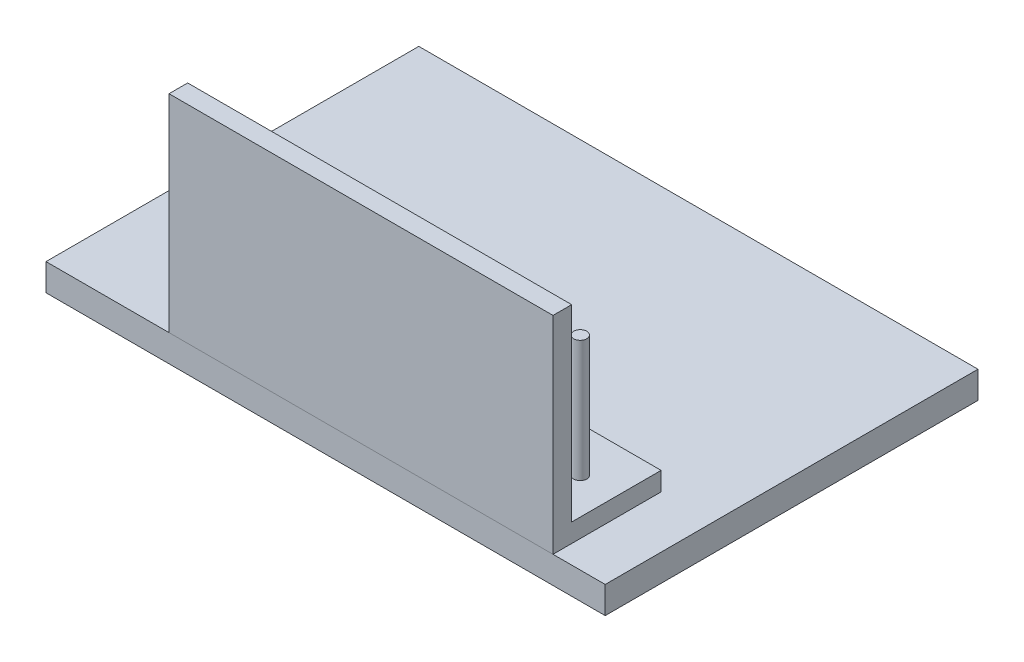
ISO-10303-21;
HEADER;
FILE_DESCRIPTION(('STEP AP214'),'2;1');
FILE_NAME('part.step','',(''),(''),'','','');
FILE_SCHEMA(('AUTOMOTIVE_DESIGN { 1 0 10303 214 1 1 1 1 }'));
ENDSEC;
DATA;
#1=APPLICATION_CONTEXT('core data for automotive mechanical design processes');
#2=APPLICATION_PROTOCOL_DEFINITION('international standard','automotive_design',2000,#1);
#3=PRODUCT_CONTEXT('',#1,'mechanical');
#4=PRODUCT('Part','Part','',(#3));
#5=PRODUCT_RELATED_PRODUCT_CATEGORY('part','',(#4));
#6=PRODUCT_DEFINITION_FORMATION('','',#4);
#7=PRODUCT_DEFINITION_CONTEXT('part definition',#1,'design');
#8=PRODUCT_DEFINITION('design','',#6,#7);
#9=PRODUCT_DEFINITION_SHAPE('','',#8);
#10=(LENGTH_UNIT() NAMED_UNIT(*) SI_UNIT(.MILLI.,.METRE.));
#11=(NAMED_UNIT(*) PLANE_ANGLE_UNIT() SI_UNIT($,.RADIAN.));
#12=(NAMED_UNIT(*) SI_UNIT($,.STERADIAN.) SOLID_ANGLE_UNIT());
#13=UNCERTAINTY_MEASURE_WITH_UNIT(LENGTH_MEASURE(1.E-05),#10,'distance_accuracy_value','');
#14=(GEOMETRIC_REPRESENTATION_CONTEXT(3) GLOBAL_UNCERTAINTY_ASSIGNED_CONTEXT((#13)) GLOBAL_UNIT_ASSIGNED_CONTEXT((#10,
#11,#12)) REPRESENTATION_CONTEXT('',''));
#15=CARTESIAN_POINT('',(0.,0.,0.));
#16=DIRECTION('',(0.,0.,1.));
#17=DIRECTION('',(1.,0.,0.));
#18=AXIS2_PLACEMENT_3D('',#15,#16,#17);
#19=CARTESIAN_POINT('',(22.8718219077427,8.97,16.6));
#20=DIRECTION('',(0.,-1.,0.));
#21=DIRECTION('',(0.,0.,1.));
#22=AXIS2_PLACEMENT_3D('',#19,#20,#21);
#23=CYLINDRICAL_SURFACE('',#22,0.350000000000001);
#24=CARTESIAN_POINT('',(22.8718219077427,8.97,16.6));
#25=DIRECTION('',(0.,-1.,0.));
#26=DIRECTION('',(0.,0.,-1.));
#27=AXIS2_PLACEMENT_3D('',#24,#25,#26);
#28=CIRCLE('',#27,0.350000000000001);
#29=CARTESIAN_POINT('',(22.8718219077427,8.97,16.25));
#30=VERTEX_POINT('',#29);
#31=EDGE_CURVE('E11',#30,#30,#28,.T.);
#32=ORIENTED_EDGE('',*,*,#31,.T.);
#33=EDGE_LOOP('',(#32));
#34=FACE_BOUND('',#33,.T.);
#35=CARTESIAN_POINT('',(22.8718219077427,2.45,16.6));
#36=DIRECTION('',(0.,-1.,0.));
#37=DIRECTION('',(0.,0.,-1.));
#38=AXIS2_PLACEMENT_3D('',#35,#36,#37);
#39=CIRCLE('',#38,0.350000000000001);
#40=CARTESIAN_POINT('',(22.8718219077427,2.45,16.25));
#41=VERTEX_POINT('',#40);
#42=EDGE_CURVE('E49',#41,#41,#39,.T.);
#43=ORIENTED_EDGE('',*,*,#42,.F.);
#44=EDGE_LOOP('',(#43));
#45=FACE_BOUND('',#44,.T.);
#46=ADVANCED_FACE('F46',(#34,#45),#23,.T.);
#47=CARTESIAN_POINT('',(22.8718219077427,8.97,16.6));
#48=DIRECTION('',(0.,1.,0.));
#49=DIRECTION('',(0.,0.,-1.));
#50=AXIS2_PLACEMENT_3D('',#47,#48,#49);
#51=PLANE('',#50);
#52=ORIENTED_EDGE('',*,*,#31,.F.);
#53=EDGE_LOOP('',(#52));
#54=FACE_BOUND('',#53,.T.);
#55=ADVANCED_FACE('F61',(#54),#51,.T.);
#56=CARTESIAN_POINT('',(22.8718219077427,2.45,16.6));
#57=DIRECTION('',(0.,1.,0.));
#58=DIRECTION('',(0.,0.,-1.));
#59=AXIS2_PLACEMENT_3D('',#56,#57,#58);
#60=PLANE('',#59);
#61=ORIENTED_EDGE('',*,*,#42,.T.);
#62=EDGE_LOOP('',(#61));
#63=FACE_BOUND('',#62,.T.);
#64=ADVANCED_FACE('F58',(#63),#60,.F.);
#65=CLOSED_SHELL('',(#46,#55,#64));
#66=MANIFOLD_SOLID_BREP('B2',#65);
#67=CARTESIAN_POINT('',(20.4830931446457,8.97,16.6));
#68=DIRECTION('',(0.,-1.,0.));
#69=DIRECTION('',(0.,0.,1.));
#70=AXIS2_PLACEMENT_3D('',#67,#68,#69);
#71=CYLINDRICAL_SURFACE('',#70,0.350000000000001);
#72=CARTESIAN_POINT('',(20.4830931446457,8.97,16.6));
#73=DIRECTION('',(0.,-1.,0.));
#74=DIRECTION('',(0.,0.,-1.));
#75=AXIS2_PLACEMENT_3D('',#72,#73,#74);
#76=CIRCLE('',#75,0.350000000000001);
#77=CARTESIAN_POINT('',(20.4830931446457,8.97,16.25));
#78=VERTEX_POINT('',#77);
#79=EDGE_CURVE('E45',#78,#78,#76,.T.);
#80=ORIENTED_EDGE('',*,*,#79,.T.);
#81=EDGE_LOOP('',(#80));
#82=FACE_BOUND('',#81,.T.);
#83=CARTESIAN_POINT('',(20.4830931446457,2.45,16.6));
#84=DIRECTION('',(0.,-1.,0.));
#85=DIRECTION('',(0.,0.,-1.));
#86=AXIS2_PLACEMENT_3D('',#83,#84,#85);
#87=CIRCLE('',#86,0.350000000000001);
#88=CARTESIAN_POINT('',(20.4830931446457,2.45,16.25));
#89=VERTEX_POINT('',#88);
#90=EDGE_CURVE('E98',#89,#89,#87,.T.);
#91=ORIENTED_EDGE('',*,*,#90,.F.);
#92=EDGE_LOOP('',(#91));
#93=FACE_BOUND('',#92,.T.);
#94=ADVANCED_FACE('F95',(#82,#93),#71,.T.);
#95=CARTESIAN_POINT('',(20.4830931446457,8.97,16.6));
#96=DIRECTION('',(0.,1.,0.));
#97=DIRECTION('',(0.,0.,-1.));
#98=AXIS2_PLACEMENT_3D('',#95,#96,#97);
#99=PLANE('',#98);
#100=ORIENTED_EDGE('',*,*,#79,.F.);
#101=EDGE_LOOP('',(#100));
#102=FACE_BOUND('',#101,.T.);
#103=ADVANCED_FACE('F110',(#102),#99,.T.);
#104=CARTESIAN_POINT('',(20.4830931446457,2.45,16.6));
#105=DIRECTION('',(0.,1.,0.));
#106=DIRECTION('',(0.,0.,-1.));
#107=AXIS2_PLACEMENT_3D('',#104,#105,#106);
#108=PLANE('',#107);
#109=ORIENTED_EDGE('',*,*,#90,.T.);
#110=EDGE_LOOP('',(#109));
#111=FACE_BOUND('',#110,.T.);
#112=ADVANCED_FACE('F107',(#111),#108,.F.);
#113=CLOSED_SHELL('',(#94,#103,#112));
#114=MANIFOLD_SOLID_BREP('B6',#113);
#115=CARTESIAN_POINT('',(18.0943643815486,8.97,16.6));
#116=DIRECTION('',(0.,-1.,0.));
#117=DIRECTION('',(0.,0.,1.));
#118=AXIS2_PLACEMENT_3D('',#115,#116,#117);
#119=CYLINDRICAL_SURFACE('',#118,0.350000000000001);
#120=CARTESIAN_POINT('',(18.0943643815486,8.97,16.6));
#121=DIRECTION('',(0.,-1.,0.));
#122=DIRECTION('',(0.,0.,-1.));
#123=AXIS2_PLACEMENT_3D('',#120,#121,#122);
#124=CIRCLE('',#123,0.350000000000001);
#125=CARTESIAN_POINT('',(18.0943643815486,8.97,16.25));
#126=VERTEX_POINT('',#125);
#127=EDGE_CURVE('E94',#126,#126,#124,.T.);
#128=ORIENTED_EDGE('',*,*,#127,.T.);
#129=EDGE_LOOP('',(#128));
#130=FACE_BOUND('',#129,.T.);
#131=CARTESIAN_POINT('',(18.0943643815486,2.45,16.6));
#132=DIRECTION('',(0.,-1.,0.));
#133=DIRECTION('',(0.,0.,-1.));
#134=AXIS2_PLACEMENT_3D('',#131,#132,#133);
#135=CIRCLE('',#134,0.350000000000001);
#136=CARTESIAN_POINT('',(18.0943643815486,2.45,16.25));
#137=VERTEX_POINT('',#136);
#138=EDGE_CURVE('E147',#137,#137,#135,.T.);
#139=ORIENTED_EDGE('',*,*,#138,.F.);
#140=EDGE_LOOP('',(#139));
#141=FACE_BOUND('',#140,.T.);
#142=ADVANCED_FACE('F144',(#130,#141),#119,.T.);
#143=CARTESIAN_POINT('',(18.0943643815486,8.97,16.6));
#144=DIRECTION('',(0.,1.,0.));
#145=DIRECTION('',(0.,0.,-1.));
#146=AXIS2_PLACEMENT_3D('',#143,#144,#145);
#147=PLANE('',#146);
#148=ORIENTED_EDGE('',*,*,#127,.F.);
#149=EDGE_LOOP('',(#148));
#150=FACE_BOUND('',#149,.T.);
#151=ADVANCED_FACE('F159',(#150),#147,.T.);
#152=CARTESIAN_POINT('',(18.0943643815486,2.45,16.6));
#153=DIRECTION('',(0.,1.,0.));
#154=DIRECTION('',(0.,0.,-1.));
#155=AXIS2_PLACEMENT_3D('',#152,#153,#154);
#156=PLANE('',#155);
#157=ORIENTED_EDGE('',*,*,#138,.T.);
#158=EDGE_LOOP('',(#157));
#159=FACE_BOUND('',#158,.T.);
#160=ADVANCED_FACE('F156',(#159),#156,.F.);
#161=CLOSED_SHELL('',(#142,#151,#160));
#162=MANIFOLD_SOLID_BREP('B40',#161);
#163=CARTESIAN_POINT('',(15.7056356184514,8.97,16.6));
#164=DIRECTION('',(0.,-1.,0.));
#165=DIRECTION('',(0.,0.,1.));
#166=AXIS2_PLACEMENT_3D('',#163,#164,#165);
#167=CYLINDRICAL_SURFACE('',#166,0.350000000000001);
#168=CARTESIAN_POINT('',(15.7056356184514,8.97,16.6));
#169=DIRECTION('',(0.,-1.,0.));
#170=DIRECTION('',(0.,0.,-1.));
#171=AXIS2_PLACEMENT_3D('',#168,#169,#170);
#172=CIRCLE('',#171,0.350000000000001);
#173=CARTESIAN_POINT('',(15.7056356184514,8.97,16.25));
#174=VERTEX_POINT('',#173);
#175=EDGE_CURVE('E143',#174,#174,#172,.T.);
#176=ORIENTED_EDGE('',*,*,#175,.T.);
#177=EDGE_LOOP('',(#176));
#178=FACE_BOUND('',#177,.T.);
#179=CARTESIAN_POINT('',(15.7056356184514,2.45,16.6));
#180=DIRECTION('',(0.,-1.,0.));
#181=DIRECTION('',(0.,0.,-1.));
#182=AXIS2_PLACEMENT_3D('',#179,#180,#181);
#183=CIRCLE('',#182,0.350000000000001);
#184=CARTESIAN_POINT('',(15.7056356184514,2.45,16.25));
#185=VERTEX_POINT('',#184);
#186=EDGE_CURVE('E196',#185,#185,#183,.T.);
#187=ORIENTED_EDGE('',*,*,#186,.F.);
#188=EDGE_LOOP('',(#187));
#189=FACE_BOUND('',#188,.T.);
#190=ADVANCED_FACE('F193',(#178,#189),#167,.T.);
#191=CARTESIAN_POINT('',(15.7056356184514,8.97,16.6));
#192=DIRECTION('',(0.,1.,0.));
#193=DIRECTION('',(0.,0.,-1.));
#194=AXIS2_PLACEMENT_3D('',#191,#192,#193);
#195=PLANE('',#194);
#196=ORIENTED_EDGE('',*,*,#175,.F.);
#197=EDGE_LOOP('',(#196));
#198=FACE_BOUND('',#197,.T.);
#199=ADVANCED_FACE('F208',(#198),#195,.T.);
#200=CARTESIAN_POINT('',(15.7056356184514,2.45,16.6));
#201=DIRECTION('',(0.,1.,0.));
#202=DIRECTION('',(0.,0.,-1.));
#203=AXIS2_PLACEMENT_3D('',#200,#201,#202);
#204=PLANE('',#203);
#205=ORIENTED_EDGE('',*,*,#186,.T.);
#206=EDGE_LOOP('',(#205));
#207=FACE_BOUND('',#206,.T.);
#208=ADVANCED_FACE('F205',(#207),#204,.F.);
#209=CLOSED_SHELL('',(#190,#199,#208));
#210=MANIFOLD_SOLID_BREP('B89',#209);
#211=CARTESIAN_POINT('',(13.3169068553543,8.97,16.6));
#212=DIRECTION('',(0.,-1.,0.));
#213=DIRECTION('',(0.,0.,1.));
#214=AXIS2_PLACEMENT_3D('',#211,#212,#213);
#215=CYLINDRICAL_SURFACE('',#214,0.349999999999999);
#216=CARTESIAN_POINT('',(13.3169068553543,8.97,16.6));
#217=DIRECTION('',(0.,-1.,0.));
#218=DIRECTION('',(0.,0.,-1.));
#219=AXIS2_PLACEMENT_3D('',#216,#217,#218);
#220=CIRCLE('',#219,0.349999999999999);
#221=CARTESIAN_POINT('',(13.3169068553543,8.97,16.25));
#222=VERTEX_POINT('',#221);
#223=EDGE_CURVE('E192',#222,#222,#220,.T.);
#224=ORIENTED_EDGE('',*,*,#223,.T.);
#225=EDGE_LOOP('',(#224));
#226=FACE_BOUND('',#225,.T.);
#227=CARTESIAN_POINT('',(13.3169068553543,2.45,16.6));
#228=DIRECTION('',(0.,-1.,0.));
#229=DIRECTION('',(0.,0.,-1.));
#230=AXIS2_PLACEMENT_3D('',#227,#228,#229);
#231=CIRCLE('',#230,0.349999999999999);
#232=CARTESIAN_POINT('',(13.3169068553543,2.45,16.25));
#233=VERTEX_POINT('',#232);
#234=EDGE_CURVE('E245',#233,#233,#231,.T.);
#235=ORIENTED_EDGE('',*,*,#234,.F.);
#236=EDGE_LOOP('',(#235));
#237=FACE_BOUND('',#236,.T.);
#238=ADVANCED_FACE('F242',(#226,#237),#215,.T.);
#239=CARTESIAN_POINT('',(13.3169068553543,8.97,16.6));
#240=DIRECTION('',(0.,1.,0.));
#241=DIRECTION('',(0.,0.,-1.));
#242=AXIS2_PLACEMENT_3D('',#239,#240,#241);
#243=PLANE('',#242);
#244=ORIENTED_EDGE('',*,*,#223,.F.);
#245=EDGE_LOOP('',(#244));
#246=FACE_BOUND('',#245,.T.);
#247=ADVANCED_FACE('F257',(#246),#243,.T.);
#248=CARTESIAN_POINT('',(13.3169068553543,2.45,16.6));
#249=DIRECTION('',(0.,1.,0.));
#250=DIRECTION('',(0.,0.,-1.));
#251=AXIS2_PLACEMENT_3D('',#248,#249,#250);
#252=PLANE('',#251);
#253=ORIENTED_EDGE('',*,*,#234,.T.);
#254=EDGE_LOOP('',(#253));
#255=FACE_BOUND('',#254,.T.);
#256=ADVANCED_FACE('F254',(#255),#252,.F.);
#257=CLOSED_SHELL('',(#238,#247,#256));
#258=MANIFOLD_SOLID_BREP('B138',#257);
#259=CARTESIAN_POINT('',(10.9281780922572,8.97,16.6));
#260=DIRECTION('',(0.,-1.,0.));
#261=DIRECTION('',(0.,0.,1.));
#262=AXIS2_PLACEMENT_3D('',#259,#260,#261);
#263=CYLINDRICAL_SURFACE('',#262,0.349999999999999);
#264=CARTESIAN_POINT('',(10.9281780922572,8.97,16.6));
#265=DIRECTION('',(0.,-1.,0.));
#266=DIRECTION('',(0.,0.,-1.));
#267=AXIS2_PLACEMENT_3D('',#264,#265,#266);
#268=CIRCLE('',#267,0.349999999999999);
#269=CARTESIAN_POINT('',(10.9281780922572,8.97,16.25));
#270=VERTEX_POINT('',#269);
#271=EDGE_CURVE('E241',#270,#270,#268,.T.);
#272=ORIENTED_EDGE('',*,*,#271,.T.);
#273=EDGE_LOOP('',(#272));
#274=FACE_BOUND('',#273,.T.);
#275=CARTESIAN_POINT('',(10.9281780922572,2.45,16.6));
#276=DIRECTION('',(0.,-1.,0.));
#277=DIRECTION('',(0.,0.,-1.));
#278=AXIS2_PLACEMENT_3D('',#275,#276,#277);
#279=CIRCLE('',#278,0.349999999999999);
#280=CARTESIAN_POINT('',(10.9281780922572,2.45,16.25));
#281=VERTEX_POINT('',#280);
#282=EDGE_CURVE('E294',#281,#281,#279,.T.);
#283=ORIENTED_EDGE('',*,*,#282,.F.);
#284=EDGE_LOOP('',(#283));
#285=FACE_BOUND('',#284,.T.);
#286=ADVANCED_FACE('F291',(#274,#285),#263,.T.);
#287=CARTESIAN_POINT('',(10.9281780922572,8.97,16.6));
#288=DIRECTION('',(0.,1.,0.));
#289=DIRECTION('',(0.,0.,-1.));
#290=AXIS2_PLACEMENT_3D('',#287,#288,#289);
#291=PLANE('',#290);
#292=ORIENTED_EDGE('',*,*,#271,.F.);
#293=EDGE_LOOP('',(#292));
#294=FACE_BOUND('',#293,.T.);
#295=ADVANCED_FACE('F306',(#294),#291,.T.);
#296=CARTESIAN_POINT('',(10.9281780922572,2.45,16.6));
#297=DIRECTION('',(0.,1.,0.));
#298=DIRECTION('',(0.,0.,-1.));
#299=AXIS2_PLACEMENT_3D('',#296,#297,#298);
#300=PLANE('',#299);
#301=ORIENTED_EDGE('',*,*,#282,.T.);
#302=EDGE_LOOP('',(#301));
#303=FACE_BOUND('',#302,.T.);
#304=ADVANCED_FACE('F303',(#303),#300,.F.);
#305=CLOSED_SHELL('',(#286,#295,#304));
#306=MANIFOLD_SOLID_BREP('B187',#305);
#307=CARTESIAN_POINT('',(8.53944932916015,8.97,16.6));
#308=DIRECTION('',(0.,-1.,0.));
#309=DIRECTION('',(0.,0.,1.));
#310=AXIS2_PLACEMENT_3D('',#307,#308,#309);
#311=CYLINDRICAL_SURFACE('',#310,0.349999999999999);
#312=CARTESIAN_POINT('',(8.53944932916015,8.97,16.6));
#313=DIRECTION('',(0.,-1.,0.));
#314=DIRECTION('',(0.,0.,-1.));
#315=AXIS2_PLACEMENT_3D('',#312,#313,#314);
#316=CIRCLE('',#315,0.349999999999999);
#317=CARTESIAN_POINT('',(8.53944932916015,8.97,16.25));
#318=VERTEX_POINT('',#317);
#319=EDGE_CURVE('E290',#318,#318,#316,.T.);
#320=ORIENTED_EDGE('',*,*,#319,.T.);
#321=EDGE_LOOP('',(#320));
#322=FACE_BOUND('',#321,.T.);
#323=CARTESIAN_POINT('',(8.53944932916015,2.45,16.6));
#324=DIRECTION('',(0.,-1.,0.));
#325=DIRECTION('',(0.,0.,-1.));
#326=AXIS2_PLACEMENT_3D('',#323,#324,#325);
#327=CIRCLE('',#326,0.349999999999999);
#328=CARTESIAN_POINT('',(8.53944932916015,2.45,16.25));
#329=VERTEX_POINT('',#328);
#330=EDGE_CURVE('E343',#329,#329,#327,.T.);
#331=ORIENTED_EDGE('',*,*,#330,.F.);
#332=EDGE_LOOP('',(#331));
#333=FACE_BOUND('',#332,.T.);
#334=ADVANCED_FACE('F340',(#322,#333),#311,.T.);
#335=CARTESIAN_POINT('',(8.53944932916015,8.97,16.6));
#336=DIRECTION('',(0.,1.,0.));
#337=DIRECTION('',(0.,0.,-1.));
#338=AXIS2_PLACEMENT_3D('',#335,#336,#337);
#339=PLANE('',#338);
#340=ORIENTED_EDGE('',*,*,#319,.F.);
#341=EDGE_LOOP('',(#340));
#342=FACE_BOUND('',#341,.T.);
#343=ADVANCED_FACE('F355',(#342),#339,.T.);
#344=CARTESIAN_POINT('',(8.53944932916015,2.45,16.6));
#345=DIRECTION('',(0.,1.,0.));
#346=DIRECTION('',(0.,0.,-1.));
#347=AXIS2_PLACEMENT_3D('',#344,#345,#346);
#348=PLANE('',#347);
#349=ORIENTED_EDGE('',*,*,#330,.T.);
#350=EDGE_LOOP('',(#349));
#351=FACE_BOUND('',#350,.T.);
#352=ADVANCED_FACE('F352',(#351),#348,.F.);
#353=CLOSED_SHELL('',(#334,#343,#352));
#354=MANIFOLD_SOLID_BREP('B236',#353);
#355=CARTESIAN_POINT('',(25.2605506708399,8.97,16.6));
#356=DIRECTION('',(0.,-1.,0.));
#357=DIRECTION('',(0.,0.,1.));
#358=AXIS2_PLACEMENT_3D('',#355,#356,#357);
#359=CYLINDRICAL_SURFACE('',#358,0.350000000000001);
#360=CARTESIAN_POINT('',(25.2605506708399,8.97,16.6));
#361=DIRECTION('',(0.,-1.,0.));
#362=DIRECTION('',(0.,0.,-1.));
#363=AXIS2_PLACEMENT_3D('',#360,#361,#362);
#364=CIRCLE('',#363,0.350000000000001);
#365=CARTESIAN_POINT('',(25.2605506708399,8.97,16.25));
#366=VERTEX_POINT('',#365);
#367=EDGE_CURVE('E339',#366,#366,#364,.T.);
#368=ORIENTED_EDGE('',*,*,#367,.T.);
#369=EDGE_LOOP('',(#368));
#370=FACE_BOUND('',#369,.T.);
#371=CARTESIAN_POINT('',(25.2605506708399,2.45,16.6));
#372=DIRECTION('',(0.,-1.,0.));
#373=DIRECTION('',(0.,0.,-1.));
#374=AXIS2_PLACEMENT_3D('',#371,#372,#373);
#375=CIRCLE('',#374,0.350000000000001);
#376=CARTESIAN_POINT('',(25.2605506708399,2.45,16.25));
#377=VERTEX_POINT('',#376);
#378=EDGE_CURVE('E395',#377,#377,#375,.T.);
#379=ORIENTED_EDGE('',*,*,#378,.F.);
#380=EDGE_LOOP('',(#379));
#381=FACE_BOUND('',#380,.T.);
#382=ADVANCED_FACE('F392',(#370,#381),#359,.T.);
#383=CARTESIAN_POINT('',(25.2605506708399,8.97,16.6));
#384=DIRECTION('',(0.,1.,0.));
#385=DIRECTION('',(0.,0.,-1.));
#386=AXIS2_PLACEMENT_3D('',#383,#384,#385);
#387=PLANE('',#386);
#388=ORIENTED_EDGE('',*,*,#367,.F.);
#389=EDGE_LOOP('',(#388));
#390=FACE_BOUND('',#389,.T.);
#391=ADVANCED_FACE('F407',(#390),#387,.T.);
#392=CARTESIAN_POINT('',(25.2605506708399,2.45,16.6));
#393=DIRECTION('',(0.,1.,0.));
#394=DIRECTION('',(0.,0.,-1.));
#395=AXIS2_PLACEMENT_3D('',#392,#393,#394);
#396=PLANE('',#395);
#397=ORIENTED_EDGE('',*,*,#378,.T.);
#398=EDGE_LOOP('',(#397));
#399=FACE_BOUND('',#398,.T.);
#400=ADVANCED_FACE('F404',(#399),#396,.F.);
#401=CLOSED_SHELL('',(#382,#391,#400));
#402=MANIFOLD_SOLID_BREP('B285',#401);
#403=CARTESIAN_POINT('',(0.,12.55,0.));
#404=DIRECTION('',(0.,1.,0.));
#405=DIRECTION('',(0.,0.,-1.));
#406=AXIS2_PLACEMENT_3D('',#403,#404,#405);
#407=PLANE('',#406);
#408=DIRECTION('',(0.,0.,-1.));
#409=VECTOR('',#408,1.);
#410=CARTESIAN_POINT('',(6.6,12.55,20.));
#411=LINE('',#410,#409);
#412=CARTESIAN_POINT('',(6.6,12.55,20.));
#413=VERTEX_POINT('',#412);
#414=CARTESIAN_POINT('',(6.6,12.55,19.));
#415=VERTEX_POINT('',#414);
#416=EDGE_CURVE('E495',#413,#415,#411,.T.);
#417=ORIENTED_EDGE('',*,*,#416,.F.);
#418=DIRECTION('',(-1.,0.,0.));
#419=VECTOR('',#418,1.);
#420=CARTESIAN_POINT('',(6.6,12.55,20.));
#421=LINE('',#420,#419);
#422=CARTESIAN_POINT('',(27.2,12.55,20.));
#423=VERTEX_POINT('',#422);
#424=EDGE_CURVE('E499',#423,#413,#421,.T.);
#425=ORIENTED_EDGE('',*,*,#424,.F.);
#426=DIRECTION('',(0.,0.,1.));
#427=VECTOR('',#426,1.);
#428=CARTESIAN_POINT('',(27.2,12.55,20.));
#429=LINE('',#428,#427);
#430=CARTESIAN_POINT('',(27.2,12.55,19.));
#431=VERTEX_POINT('',#430);
#432=EDGE_CURVE('E546',#431,#423,#429,.T.);
#433=ORIENTED_EDGE('',*,*,#432,.F.);
#434=DIRECTION('',(1.,0.,0.));
#435=VECTOR('',#434,1.);
#436=CARTESIAN_POINT('',(6.6,12.55,19.));
#437=LINE('',#436,#435);
#438=EDGE_CURVE('E541',#415,#431,#437,.T.);
#439=ORIENTED_EDGE('',*,*,#438,.F.);
#440=EDGE_LOOP('',(#417,#425,#433,#439));
#441=FACE_BOUND('',#440,.T.);
#442=ADVANCED_FACE('F444',(#441),#407,.T.);
#443=CARTESIAN_POINT('',(6.6,12.55,20.));
#444=DIRECTION('',(1.,0.,0.));
#445=DIRECTION('',(0.,0.,1.));
#446=AXIS2_PLACEMENT_3D('',#443,#444,#445);
#447=PLANE('',#446);
#448=DIRECTION('',(0.,-1.,0.));
#449=VECTOR('',#448,1.);
#450=CARTESIAN_POINT('',(6.6,12.55,14.2));
#451=LINE('',#450,#449);
#452=CARTESIAN_POINT('',(6.6,2.45,14.2));
#453=VERTEX_POINT('',#452);
#454=CARTESIAN_POINT('',(6.6,1.45,14.2));
#455=VERTEX_POINT('',#454);
#456=EDGE_CURVE('E390',#453,#455,#451,.T.);
#457=ORIENTED_EDGE('',*,*,#456,.T.);
#458=DIRECTION('',(0.,0.,-1.));
#459=VECTOR('',#458,1.);
#460=CARTESIAN_POINT('',(6.6,1.45,20.));
#461=LINE('',#460,#459);
#462=CARTESIAN_POINT('',(6.6,1.45,20.));
#463=VERTEX_POINT('',#462);
#464=EDGE_CURVE('E491',#463,#455,#461,.T.);
#465=ORIENTED_EDGE('',*,*,#464,.F.);
#466=DIRECTION('',(0.,-1.,0.));
#467=VECTOR('',#466,1.);
#468=CARTESIAN_POINT('',(6.6,12.55,20.));
#469=LINE('',#468,#467);
#470=EDGE_CURVE('E468',#413,#463,#469,.T.);
#471=ORIENTED_EDGE('',*,*,#470,.F.);
#472=ORIENTED_EDGE('',*,*,#416,.T.);
#473=DIRECTION('',(0.,1.,0.));
#474=VECTOR('',#473,1.);
#475=CARTESIAN_POINT('',(6.6,12.55,19.));
#476=LINE('',#475,#474);
#477=CARTESIAN_POINT('',(6.6,2.45,19.));
#478=VERTEX_POINT('',#477);
#479=EDGE_CURVE('E510',#478,#415,#476,.T.);
#480=ORIENTED_EDGE('',*,*,#479,.F.);
#481=DIRECTION('',(0.,0.,-1.));
#482=VECTOR('',#481,1.);
#483=CARTESIAN_POINT('',(6.6,2.45,42.9427548476638));
#484=LINE('',#483,#482);
#485=EDGE_CURVE('E550',#478,#453,#484,.T.);
#486=ORIENTED_EDGE('',*,*,#485,.T.);
#487=EDGE_LOOP('',(#457,#465,#471,#472,#480,#486));
#488=FACE_BOUND('',#487,.T.);
#489=ADVANCED_FACE('F446',(#488),#447,.F.);
#490=CARTESIAN_POINT('',(6.6,12.55,14.2));
#491=DIRECTION('',(0.,0.,1.));
#492=DIRECTION('',(-1.,0.,0.));
#493=AXIS2_PLACEMENT_3D('',#490,#491,#492);
#494=PLANE('',#493);
#495=DIRECTION('',(0.,-1.,0.));
#496=VECTOR('',#495,1.);
#497=CARTESIAN_POINT('',(27.2,12.55,14.2));
#498=LINE('',#497,#496);
#499=CARTESIAN_POINT('',(27.2,2.45,14.2));
#500=VERTEX_POINT('',#499);
#501=CARTESIAN_POINT('',(27.2,1.45,14.2));
#502=VERTEX_POINT('',#501);
#503=EDGE_CURVE('E452',#500,#502,#498,.T.);
#504=ORIENTED_EDGE('',*,*,#503,.T.);
#505=DIRECTION('',(1.,0.,0.));
#506=VECTOR('',#505,1.);
#507=CARTESIAN_POINT('',(6.6,1.45,14.2));
#508=LINE('',#507,#506);
#509=EDGE_CURVE('E505',#455,#502,#508,.T.);
#510=ORIENTED_EDGE('',*,*,#509,.F.);
#511=ORIENTED_EDGE('',*,*,#456,.F.);
#512=DIRECTION('',(1.,0.,0.));
#513=VECTOR('',#512,1.);
#514=CARTESIAN_POINT('',(6.6,2.45,14.2));
#515=LINE('',#514,#513);
#516=EDGE_CURVE('E523',#453,#500,#515,.T.);
#517=ORIENTED_EDGE('',*,*,#516,.T.);
#518=EDGE_LOOP('',(#504,#510,#511,#517));
#519=FACE_BOUND('',#518,.T.);
#520=ADVANCED_FACE('F520',(#519),#494,.F.);
#521=CARTESIAN_POINT('',(27.2,12.55,20.));
#522=DIRECTION('',(-1.,0.,0.));
#523=DIRECTION('',(0.,0.,-1.));
#524=AXIS2_PLACEMENT_3D('',#521,#522,#523);
#525=PLANE('',#524);
#526=DIRECTION('',(0.,-1.,0.));
#527=VECTOR('',#526,1.);
#528=CARTESIAN_POINT('',(27.2,12.55,19.));
#529=LINE('',#528,#527);
#530=CARTESIAN_POINT('',(27.2,2.45,19.));
#531=VERTEX_POINT('',#530);
#532=EDGE_CURVE('E459',#431,#531,#529,.T.);
#533=ORIENTED_EDGE('',*,*,#532,.F.);
#534=ORIENTED_EDGE('',*,*,#432,.T.);
#535=DIRECTION('',(0.,-1.,0.));
#536=VECTOR('',#535,1.);
#537=CARTESIAN_POINT('',(27.2,12.55,20.));
#538=LINE('',#537,#536);
#539=CARTESIAN_POINT('',(27.2,1.45,20.));
#540=VERTEX_POINT('',#539);
#541=EDGE_CURVE('E501',#423,#540,#538,.T.);
#542=ORIENTED_EDGE('',*,*,#541,.T.);
#543=DIRECTION('',(0.,0.,1.));
#544=VECTOR('',#543,1.);
#545=CARTESIAN_POINT('',(27.2,1.45,20.));
#546=LINE('',#545,#544);
#547=EDGE_CURVE('E492',#502,#540,#546,.T.);
#548=ORIENTED_EDGE('',*,*,#547,.F.);
#549=ORIENTED_EDGE('',*,*,#503,.F.);
#550=DIRECTION('',(0.,0.,-1.));
#551=VECTOR('',#550,1.);
#552=CARTESIAN_POINT('',(27.2,2.45,42.9427548476638));
#553=LINE('',#552,#551);
#554=EDGE_CURVE('E527',#531,#500,#553,.T.);
#555=ORIENTED_EDGE('',*,*,#554,.F.);
#556=EDGE_LOOP('',(#533,#534,#542,#548,#549,#555));
#557=FACE_BOUND('',#556,.T.);
#558=ADVANCED_FACE('F524',(#557),#525,.F.);
#559=CARTESIAN_POINT('',(6.6,12.55,20.));
#560=DIRECTION('',(0.,0.,-1.));
#561=DIRECTION('',(1.,0.,0.));
#562=AXIS2_PLACEMENT_3D('',#559,#560,#561);
#563=PLANE('',#562);
#564=DIRECTION('',(-1.,0.,0.));
#565=VECTOR('',#564,1.);
#566=CARTESIAN_POINT('',(6.6,1.45,20.));
#567=LINE('',#566,#565);
#568=EDGE_CURVE('E488',#540,#463,#567,.T.);
#569=ORIENTED_EDGE('',*,*,#568,.F.);
#570=ORIENTED_EDGE('',*,*,#541,.F.);
#571=ORIENTED_EDGE('',*,*,#424,.T.);
#572=ORIENTED_EDGE('',*,*,#470,.T.);
#573=EDGE_LOOP('',(#569,#570,#571,#572));
#574=FACE_BOUND('',#573,.T.);
#575=ADVANCED_FACE('F497',(#574),#563,.F.);
#576=CARTESIAN_POINT('',(0.,1.45,0.));
#577=DIRECTION('',(0.,1.,0.));
#578=DIRECTION('',(0.,0.,-1.));
#579=AXIS2_PLACEMENT_3D('',#576,#577,#578);
#580=PLANE('',#579);
#581=ORIENTED_EDGE('',*,*,#464,.T.);
#582=ORIENTED_EDGE('',*,*,#509,.T.);
#583=ORIENTED_EDGE('',*,*,#547,.T.);
#584=ORIENTED_EDGE('',*,*,#568,.T.);
#585=EDGE_LOOP('',(#581,#582,#583,#584));
#586=FACE_BOUND('',#585,.T.);
#587=ADVANCED_FACE('F489',(#586),#580,.F.);
#588=CARTESIAN_POINT('',(6.6,2.45,42.9427548476638));
#589=DIRECTION('',(0.,-1.,0.));
#590=DIRECTION('',(1.,0.,0.));
#591=AXIS2_PLACEMENT_3D('',#588,#589,#590);
#592=PLANE('',#591);
#593=DIRECTION('',(-1.,0.,0.));
#594=VECTOR('',#593,1.);
#595=CARTESIAN_POINT('',(6.6,2.45,19.));
#596=LINE('',#595,#594);
#597=EDGE_CURVE('E506',#531,#478,#596,.T.);
#598=ORIENTED_EDGE('',*,*,#597,.F.);
#599=ORIENTED_EDGE('',*,*,#554,.T.);
#600=ORIENTED_EDGE('',*,*,#516,.F.);
#601=ORIENTED_EDGE('',*,*,#485,.F.);
#602=EDGE_LOOP('',(#598,#599,#600,#601));
#603=FACE_BOUND('',#602,.T.);
#604=ADVANCED_FACE('F554',(#603),#592,.F.);
#605=CARTESIAN_POINT('',(6.6,12.55,19.));
#606=DIRECTION('',(0.,0.,-1.));
#607=DIRECTION('',(1.,0.,0.));
#608=AXIS2_PLACEMENT_3D('',#605,#606,#607);
#609=PLANE('',#608);
#610=ORIENTED_EDGE('',*,*,#479,.T.);
#611=ORIENTED_EDGE('',*,*,#438,.T.);
#612=ORIENTED_EDGE('',*,*,#532,.T.);
#613=ORIENTED_EDGE('',*,*,#597,.T.);
#614=EDGE_LOOP('',(#610,#611,#612,#613));
#615=FACE_BOUND('',#614,.T.);
#616=ADVANCED_FACE('F540',(#615),#609,.T.);
#617=CLOSED_SHELL('',(#442,#489,#520,#558,#575,#587,#604,#616));
#618=MANIFOLD_SOLID_BREP('B334',#617);
#619=CARTESIAN_POINT('',(-1.,-2.85,1.));
#620=DIRECTION('',(1.,0.,0.));
#621=DIRECTION('',(0.,0.,1.));
#622=AXIS2_PLACEMENT_3D('',#619,#620,#621);
#623=PLANE('',#622);
#624=DIRECTION('',(0.,0.,1.));
#625=VECTOR('',#624,1.);
#626=CARTESIAN_POINT('',(-1.,0.,1.));
#627=LINE('',#626,#625);
#628=CARTESIAN_POINT('',(-1.,0.,1.));
#629=VERTEX_POINT('',#628);
#630=CARTESIAN_POINT('',(-0.999999999999998,0.,16.5));
#631=VERTEX_POINT('',#630);
#632=EDGE_CURVE('E692',#629,#631,#627,.T.);
#633=ORIENTED_EDGE('',*,*,#632,.F.);
#634=DIRECTION('',(0.,1.,0.));
#635=VECTOR('',#634,1.);
#636=CARTESIAN_POINT('',(-1.,-2.85,1.));
#637=LINE('',#636,#635);
#638=CARTESIAN_POINT('',(-1.,-2.85,1.));
#639=VERTEX_POINT('',#638);
#640=EDGE_CURVE('E691',#639,#629,#637,.T.);
#641=ORIENTED_EDGE('',*,*,#640,.F.);
#642=DIRECTION('',(0.,0.,1.));
#643=VECTOR('',#642,1.);
#644=CARTESIAN_POINT('',(-1.,-2.85,1.));
#645=LINE('',#644,#643);
#646=CARTESIAN_POINT('',(-0.999999999999998,-2.85,16.5));
#647=VERTEX_POINT('',#646);
#648=EDGE_CURVE('E686',#639,#647,#645,.T.);
#649=ORIENTED_EDGE('',*,*,#648,.T.);
#650=DIRECTION('',(0.,1.,0.));
#651=VECTOR('',#650,1.);
#652=CARTESIAN_POINT('',(-0.999999999999998,-2.85,16.5));
#653=LINE('',#652,#651);
#654=EDGE_CURVE('E442',#647,#631,#653,.T.);
#655=ORIENTED_EDGE('',*,*,#654,.T.);
#656=EDGE_LOOP('',(#633,#641,#649,#655));
#657=FACE_BOUND('',#656,.T.);
#658=ADVANCED_FACE('F629',(#657),#623,.F.);
#659=CARTESIAN_POINT('',(-0.999999999999998,-2.85,16.5));
#660=DIRECTION('',(0.,0.,-1.));
#661=DIRECTION('',(1.,0.,0.));
#662=AXIS2_PLACEMENT_3D('',#659,#660,#661);
#663=PLANE('',#662);
#664=DIRECTION('',(1.,0.,0.));
#665=VECTOR('',#664,1.);
#666=CARTESIAN_POINT('',(-0.999999999999998,0.,16.5));
#667=LINE('',#666,#665);
#668=CARTESIAN_POINT('',(4.75,0.,16.5));
#669=VERTEX_POINT('',#668);
#670=EDGE_CURVE('E694',#631,#669,#667,.T.);
#671=ORIENTED_EDGE('',*,*,#670,.F.);
#672=ORIENTED_EDGE('',*,*,#654,.F.);
#673=DIRECTION('',(1.,0.,0.));
#674=VECTOR('',#673,1.);
#675=CARTESIAN_POINT('',(-0.999999999999998,-2.85,16.5));
#676=LINE('',#675,#674);
#677=CARTESIAN_POINT('',(4.75,-2.85,16.5));
#678=VERTEX_POINT('',#677);
#679=EDGE_CURVE('E670',#647,#678,#676,.T.);
#680=ORIENTED_EDGE('',*,*,#679,.T.);
#681=DIRECTION('',(0.,1.,0.));
#682=VECTOR('',#681,1.);
#683=CARTESIAN_POINT('',(4.75,-2.85,16.5));
#684=LINE('',#683,#682);
#685=EDGE_CURVE('E637',#678,#669,#684,.T.);
#686=ORIENTED_EDGE('',*,*,#685,.T.);
#687=EDGE_LOOP('',(#671,#672,#680,#686));
#688=FACE_BOUND('',#687,.T.);
#689=ADVANCED_FACE('F684',(#688),#663,.F.);
#690=CARTESIAN_POINT('',(4.75,-2.85,1.));
#691=DIRECTION('',(-1.,0.,0.));
#692=DIRECTION('',(0.,0.,-1.));
#693=AXIS2_PLACEMENT_3D('',#690,#691,#692);
#694=PLANE('',#693);
#695=DIRECTION('',(0.,0.,-1.));
#696=VECTOR('',#695,1.);
#697=CARTESIAN_POINT('',(4.75,0.,1.));
#698=LINE('',#697,#696);
#699=CARTESIAN_POINT('',(4.75,0.,1.));
#700=VERTEX_POINT('',#699);
#701=EDGE_CURVE('E680',#669,#700,#698,.T.);
#702=ORIENTED_EDGE('',*,*,#701,.F.);
#703=ORIENTED_EDGE('',*,*,#685,.F.);
#704=DIRECTION('',(0.,0.,-1.));
#705=VECTOR('',#704,1.);
#706=CARTESIAN_POINT('',(4.75,-2.85,1.));
#707=LINE('',#706,#705);
#708=CARTESIAN_POINT('',(4.75,-2.85,1.));
#709=VERTEX_POINT('',#708);
#710=EDGE_CURVE('E673',#678,#709,#707,.T.);
#711=ORIENTED_EDGE('',*,*,#710,.T.);
#712=DIRECTION('',(0.,1.,0.));
#713=VECTOR('',#712,1.);
#714=CARTESIAN_POINT('',(4.75,-2.85,1.));
#715=LINE('',#714,#713);
#716=EDGE_CURVE('E683',#709,#700,#715,.T.);
#717=ORIENTED_EDGE('',*,*,#716,.T.);
#718=EDGE_LOOP('',(#702,#703,#711,#717));
#719=FACE_BOUND('',#718,.T.);
#720=ADVANCED_FACE('F679',(#719),#694,.F.);
#721=CARTESIAN_POINT('',(-1.,-2.85,1.));
#722=DIRECTION('',(0.,0.,1.));
#723=DIRECTION('',(-1.,0.,0.));
#724=AXIS2_PLACEMENT_3D('',#721,#722,#723);
#725=PLANE('',#724);
#726=DIRECTION('',(-1.,0.,0.));
#727=VECTOR('',#726,1.);
#728=CARTESIAN_POINT('',(-1.,0.,1.));
#729=LINE('',#728,#727);
#730=EDGE_CURVE('E659',#700,#629,#729,.T.);
#731=ORIENTED_EDGE('',*,*,#730,.F.);
#732=ORIENTED_EDGE('',*,*,#716,.F.);
#733=DIRECTION('',(-1.,0.,0.));
#734=VECTOR('',#733,1.);
#735=CARTESIAN_POINT('',(-1.,-2.85,1.));
#736=LINE('',#735,#734);
#737=EDGE_CURVE('E645',#709,#639,#736,.T.);
#738=ORIENTED_EDGE('',*,*,#737,.T.);
#739=ORIENTED_EDGE('',*,*,#640,.T.);
#740=EDGE_LOOP('',(#731,#732,#738,#739));
#741=FACE_BOUND('',#740,.T.);
#742=ADVANCED_FACE('F703',(#741),#725,.F.);
#743=CARTESIAN_POINT('',(0.,-2.85,0.));
#744=DIRECTION('',(0.,-1.,0.));
#745=DIRECTION('',(0.,0.,1.));
#746=AXIS2_PLACEMENT_3D('',#743,#744,#745);
#747=PLANE('',#746);
#748=ORIENTED_EDGE('',*,*,#648,.F.);
#749=ORIENTED_EDGE('',*,*,#737,.F.);
#750=ORIENTED_EDGE('',*,*,#710,.F.);
#751=ORIENTED_EDGE('',*,*,#679,.F.);
#752=EDGE_LOOP('',(#748,#749,#750,#751));
#753=FACE_BOUND('',#752,.T.);
#754=ADVANCED_FACE('F675',(#753),#747,.T.);
#755=CARTESIAN_POINT('',(0.,0.,0.));
#756=DIRECTION('',(0.,-1.,0.));
#757=DIRECTION('',(0.,0.,1.));
#758=AXIS2_PLACEMENT_3D('',#755,#756,#757);
#759=PLANE('',#758);
#760=ORIENTED_EDGE('',*,*,#632,.T.);
#761=ORIENTED_EDGE('',*,*,#670,.T.);
#762=ORIENTED_EDGE('',*,*,#701,.T.);
#763=ORIENTED_EDGE('',*,*,#730,.T.);
#764=EDGE_LOOP('',(#760,#761,#762,#763));
#765=FACE_BOUND('',#764,.T.);
#766=ADVANCED_FACE('F699',(#765),#759,.F.);
#767=CLOSED_SHELL('',(#658,#689,#720,#742,#754,#766));
#768=MANIFOLD_SOLID_BREP('B384',#767);
#769=CARTESIAN_POINT('',(0.,1.45,0.));
#770=DIRECTION('',(1.,0.,0.));
#771=DIRECTION('',(0.,0.,1.));
#772=AXIS2_PLACEMENT_3D('',#769,#770,#771);
#773=PLANE('',#772);
#774=DIRECTION('',(0.,0.,-1.));
#775=VECTOR('',#774,1.);
#776=CARTESIAN_POINT('',(0.,0.,0.));
#777=LINE('',#776,#775);
#778=CARTESIAN_POINT('',(0.,0.,20.));
#779=VERTEX_POINT('',#778);
#780=CARTESIAN_POINT('',(0.,0.,0.));
#781=VERTEX_POINT('',#780);
#782=EDGE_CURVE('E816',#779,#781,#777,.T.);
#783=ORIENTED_EDGE('',*,*,#782,.F.);
#784=DIRECTION('',(0.,-1.,0.));
#785=VECTOR('',#784,1.);
#786=CARTESIAN_POINT('',(0.,1.45,20.));
#787=LINE('',#786,#785);
#788=CARTESIAN_POINT('',(0.,1.45,20.));
#789=VERTEX_POINT('',#788);
#790=EDGE_CURVE('E815',#789,#779,#787,.T.);
#791=ORIENTED_EDGE('',*,*,#790,.F.);
#792=DIRECTION('',(0.,0.,-1.));
#793=VECTOR('',#792,1.);
#794=CARTESIAN_POINT('',(0.,1.45,0.));
#795=LINE('',#794,#793);
#796=CARTESIAN_POINT('',(0.,1.45,0.));
#797=VERTEX_POINT('',#796);
#798=EDGE_CURVE('E810',#789,#797,#795,.T.);
#799=ORIENTED_EDGE('',*,*,#798,.T.);
#800=DIRECTION('',(0.,-1.,0.));
#801=VECTOR('',#800,1.);
#802=CARTESIAN_POINT('',(0.,1.45,0.));
#803=LINE('',#802,#801);
#804=EDGE_CURVE('E627',#797,#781,#803,.T.);
#805=ORIENTED_EDGE('',*,*,#804,.T.);
#806=EDGE_LOOP('',(#783,#791,#799,#805));
#807=FACE_BOUND('',#806,.T.);
#808=ADVANCED_FACE('F753',(#807),#773,.F.);
#809=CARTESIAN_POINT('',(0.,1.45,0.));
#810=DIRECTION('',(0.,0.,1.));
#811=DIRECTION('',(-1.,0.,0.));
#812=AXIS2_PLACEMENT_3D('',#809,#810,#811);
#813=PLANE('',#812);
#814=DIRECTION('',(1.,0.,0.));
#815=VECTOR('',#814,1.);
#816=CARTESIAN_POINT('',(0.,0.,0.));
#817=LINE('',#816,#815);
#818=CARTESIAN_POINT('',(30.,0.,0.));
#819=VERTEX_POINT('',#818);
#820=EDGE_CURVE('E818',#781,#819,#817,.T.);
#821=ORIENTED_EDGE('',*,*,#820,.F.);
#822=ORIENTED_EDGE('',*,*,#804,.F.);
#823=DIRECTION('',(1.,0.,0.));
#824=VECTOR('',#823,1.);
#825=CARTESIAN_POINT('',(0.,1.45,0.));
#826=LINE('',#825,#824);
#827=CARTESIAN_POINT('',(30.,1.45,0.));
#828=VERTEX_POINT('',#827);
#829=EDGE_CURVE('E794',#797,#828,#826,.T.);
#830=ORIENTED_EDGE('',*,*,#829,.T.);
#831=DIRECTION('',(0.,-1.,0.));
#832=VECTOR('',#831,1.);
#833=CARTESIAN_POINT('',(30.,1.45,0.));
#834=LINE('',#833,#832);
#835=EDGE_CURVE('E761',#828,#819,#834,.T.);
#836=ORIENTED_EDGE('',*,*,#835,.T.);
#837=EDGE_LOOP('',(#821,#822,#830,#836));
#838=FACE_BOUND('',#837,.T.);
#839=ADVANCED_FACE('F808',(#838),#813,.F.);
#840=CARTESIAN_POINT('',(30.,1.45,0.));
#841=DIRECTION('',(-1.,0.,0.));
#842=DIRECTION('',(0.,0.,-1.));
#843=AXIS2_PLACEMENT_3D('',#840,#841,#842);
#844=PLANE('',#843);
#845=DIRECTION('',(0.,0.,1.));
#846=VECTOR('',#845,1.);
#847=CARTESIAN_POINT('',(30.,0.,0.));
#848=LINE('',#847,#846);
#849=CARTESIAN_POINT('',(30.,0.,20.));
#850=VERTEX_POINT('',#849);
#851=EDGE_CURVE('E804',#819,#850,#848,.T.);
#852=ORIENTED_EDGE('',*,*,#851,.F.);
#853=ORIENTED_EDGE('',*,*,#835,.F.);
#854=DIRECTION('',(0.,0.,1.));
#855=VECTOR('',#854,1.);
#856=CARTESIAN_POINT('',(30.,1.45,0.));
#857=LINE('',#856,#855);
#858=CARTESIAN_POINT('',(30.,1.45,20.));
#859=VERTEX_POINT('',#858);
#860=EDGE_CURVE('E797',#828,#859,#857,.T.);
#861=ORIENTED_EDGE('',*,*,#860,.T.);
#862=DIRECTION('',(0.,-1.,0.));
#863=VECTOR('',#862,1.);
#864=CARTESIAN_POINT('',(30.,1.45,20.));
#865=LINE('',#864,#863);
#866=EDGE_CURVE('E807',#859,#850,#865,.T.);
#867=ORIENTED_EDGE('',*,*,#866,.T.);
#868=EDGE_LOOP('',(#852,#853,#861,#867));
#869=FACE_BOUND('',#868,.T.);
#870=ADVANCED_FACE('F803',(#869),#844,.F.);
#871=CARTESIAN_POINT('',(0.,1.45,20.));
#872=DIRECTION('',(0.,0.,-1.));
#873=DIRECTION('',(1.,0.,0.));
#874=AXIS2_PLACEMENT_3D('',#871,#872,#873);
#875=PLANE('',#874);
#876=DIRECTION('',(-1.,0.,0.));
#877=VECTOR('',#876,1.);
#878=CARTESIAN_POINT('',(0.,0.,20.));
#879=LINE('',#878,#877);
#880=EDGE_CURVE('E783',#850,#779,#879,.T.);
#881=ORIENTED_EDGE('',*,*,#880,.F.);
#882=ORIENTED_EDGE('',*,*,#866,.F.);
#883=DIRECTION('',(-1.,0.,0.));
#884=VECTOR('',#883,1.);
#885=CARTESIAN_POINT('',(0.,1.45,20.));
#886=LINE('',#885,#884);
#887=EDGE_CURVE('E769',#859,#789,#886,.T.);
#888=ORIENTED_EDGE('',*,*,#887,.T.);
#889=ORIENTED_EDGE('',*,*,#790,.T.);
#890=EDGE_LOOP('',(#881,#882,#888,#889));
#891=FACE_BOUND('',#890,.T.);
#892=ADVANCED_FACE('F827',(#891),#875,.F.);
#893=CARTESIAN_POINT('',(0.,1.45,0.));
#894=DIRECTION('',(0.,-1.,0.));
#895=DIRECTION('',(0.,0.,1.));
#896=AXIS2_PLACEMENT_3D('',#893,#894,#895);
#897=PLANE('',#896);
#898=ORIENTED_EDGE('',*,*,#798,.F.);
#899=ORIENTED_EDGE('',*,*,#887,.F.);
#900=ORIENTED_EDGE('',*,*,#860,.F.);
#901=ORIENTED_EDGE('',*,*,#829,.F.);
#902=EDGE_LOOP('',(#898,#899,#900,#901));
#903=FACE_BOUND('',#902,.T.);
#904=ADVANCED_FACE('F799',(#903),#897,.F.);
#905=CARTESIAN_POINT('',(0.,0.,0.));
#906=DIRECTION('',(0.,-1.,0.));
#907=DIRECTION('',(0.,0.,1.));
#908=AXIS2_PLACEMENT_3D('',#905,#906,#907);
#909=PLANE('',#908);
#910=ORIENTED_EDGE('',*,*,#782,.T.);
#911=ORIENTED_EDGE('',*,*,#820,.T.);
#912=ORIENTED_EDGE('',*,*,#851,.T.);
#913=ORIENTED_EDGE('',*,*,#880,.T.);
#914=EDGE_LOOP('',(#910,#911,#912,#913));
#915=FACE_BOUND('',#914,.T.);
#916=ADVANCED_FACE('F823',(#915),#909,.T.);
#917=CLOSED_SHELL('',(#808,#839,#870,#892,#904,#916));
#918=MANIFOLD_SOLID_BREP('B436',#917);
#919=ADVANCED_BREP_SHAPE_REPRESENTATION('',(#18,#66,#114,#162,#210,#258,#306,#354,#402,#618,
#768,#918),#14);
#920=SHAPE_DEFINITION_REPRESENTATION(#9,#919);
ENDSEC;
END-ISO-10303-21;
